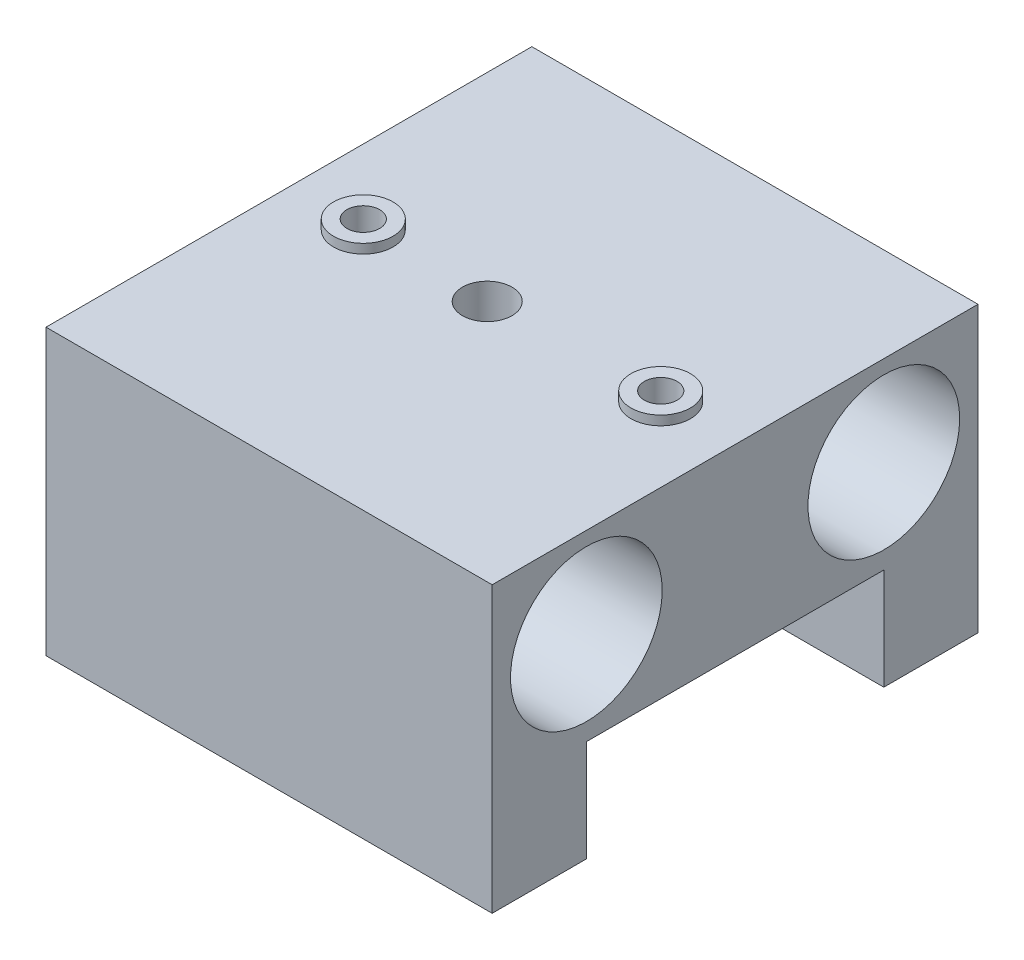
ISO-10303-21;
HEADER;
FILE_DESCRIPTION(('STEP AP214'),'2;1');
FILE_NAME('part.step','',(''),(''),'','','');
FILE_SCHEMA(('AUTOMOTIVE_DESIGN { 1 0 10303 214 1 1 1 1 }'));
ENDSEC;
DATA;
#1=APPLICATION_CONTEXT('core data for automotive mechanical design processes');
#2=APPLICATION_PROTOCOL_DEFINITION('international standard','automotive_design',2000,#1);
#3=PRODUCT_CONTEXT('',#1,'mechanical');
#4=PRODUCT('Part','Part','',(#3));
#5=PRODUCT_RELATED_PRODUCT_CATEGORY('part','',(#4));
#6=PRODUCT_DEFINITION_FORMATION('','',#4);
#7=PRODUCT_DEFINITION_CONTEXT('part definition',#1,'design');
#8=PRODUCT_DEFINITION('design','',#6,#7);
#9=PRODUCT_DEFINITION_SHAPE('','',#8);
#10=(LENGTH_UNIT() NAMED_UNIT(*) SI_UNIT(.MILLI.,.METRE.));
#11=(NAMED_UNIT(*) PLANE_ANGLE_UNIT() SI_UNIT($,.RADIAN.));
#12=(NAMED_UNIT(*) SI_UNIT($,.STERADIAN.) SOLID_ANGLE_UNIT());
#13=UNCERTAINTY_MEASURE_WITH_UNIT(LENGTH_MEASURE(1.E-05),#10,'distance_accuracy_value','');
#14=(GEOMETRIC_REPRESENTATION_CONTEXT(3) GLOBAL_UNCERTAINTY_ASSIGNED_CONTEXT((#13)) GLOBAL_UNIT_ASSIGNED_CONTEXT((#10,
#11,#12)) REPRESENTATION_CONTEXT('',''));
#15=CARTESIAN_POINT('',(0.,0.,0.));
#16=DIRECTION('',(0.,0.,1.));
#17=DIRECTION('',(1.,0.,0.));
#18=AXIS2_PLACEMENT_3D('',#15,#16,#17);
#19=CARTESIAN_POINT('',(25.0137993194186,-3.7,15.));
#20=DIRECTION('',(0.,-1.,0.));
#21=DIRECTION('',(0.,0.,-1.));
#22=AXIS2_PLACEMENT_3D('',#19,#20,#21);
#23=PLANE('',#22);
#24=DIRECTION('',(0.,0.,-1.));
#25=VECTOR('',#24,1.);
#26=CARTESIAN_POINT('',(-20.,-3.70000000000001,24.5));
#27=LINE('',#26,#25);
#28=CARTESIAN_POINT('',(-20.,-3.70000000000001,24.5));
#29=VERTEX_POINT('',#28);
#30=CARTESIAN_POINT('',(-20.,-3.70000000000001,15.));
#31=VERTEX_POINT('',#30);
#32=EDGE_CURVE('E160',#29,#31,#27,.T.);
#33=ORIENTED_EDGE('',*,*,#32,.T.);
#34=DIRECTION('',(-1.,0.,0.));
#35=VECTOR('',#34,1.);
#36=CARTESIAN_POINT('',(25.0137993194186,-3.7,15.));
#37=LINE('',#36,#35);
#38=CARTESIAN_POINT('',(25.,-3.70000000000001,15.));
#39=VERTEX_POINT('',#38);
#40=EDGE_CURVE('E11',#39,#31,#37,.T.);
#41=ORIENTED_EDGE('',*,*,#40,.F.);
#42=DIRECTION('',(0.,0.,-1.));
#43=VECTOR('',#42,1.);
#44=CARTESIAN_POINT('',(25.,-3.70000000000001,24.5));
#45=LINE('',#44,#43);
#46=CARTESIAN_POINT('',(25.,-3.70000000000001,24.5));
#47=VERTEX_POINT('',#46);
#48=EDGE_CURVE('E150',#47,#39,#45,.T.);
#49=ORIENTED_EDGE('',*,*,#48,.F.);
#50=DIRECTION('',(1.,0.,0.));
#51=VECTOR('',#50,1.);
#52=CARTESIAN_POINT('',(-40.1507273121698,-3.70000000000001,24.5));
#53=LINE('',#52,#51);
#54=EDGE_CURVE('E157',#29,#47,#53,.T.);
#55=ORIENTED_EDGE('',*,*,#54,.F.);
#56=EDGE_LOOP('',(#33,#41,#49,#55));
#57=FACE_BOUND('',#56,.T.);
#58=ADVANCED_FACE('F40',(#57),#23,.T.);
#59=CARTESIAN_POINT('',(25.0137993194186,-3.70000000000001,-24.5));
#60=DIRECTION('',(0.,-1.,0.));
#61=DIRECTION('',(0.,0.,-1.));
#62=AXIS2_PLACEMENT_3D('',#59,#60,#61);
#63=PLANE('',#62);
#64=DIRECTION('',(-1.,0.,0.));
#65=VECTOR('',#64,1.);
#66=CARTESIAN_POINT('',(25.0137993194186,-3.7,-15.));
#67=LINE('',#66,#65);
#68=CARTESIAN_POINT('',(25.,-3.7,-15.));
#69=VERTEX_POINT('',#68);
#70=CARTESIAN_POINT('',(-20.,-3.70000000000001,-15.));
#71=VERTEX_POINT('',#70);
#72=EDGE_CURVE('E125',#69,#71,#67,.T.);
#73=ORIENTED_EDGE('',*,*,#72,.T.);
#74=DIRECTION('',(0.,0.,1.));
#75=VECTOR('',#74,1.);
#76=CARTESIAN_POINT('',(-20.,-3.70000000000001,-24.5));
#77=LINE('',#76,#75);
#78=CARTESIAN_POINT('',(-20.,-3.70000000000001,-24.5));
#79=VERTEX_POINT('',#78);
#80=EDGE_CURVE('E137',#79,#71,#77,.T.);
#81=ORIENTED_EDGE('',*,*,#80,.F.);
#82=DIRECTION('',(-1.,0.,0.));
#83=VECTOR('',#82,1.);
#84=CARTESIAN_POINT('',(45.1507273121698,-3.70000000000001,-24.5));
#85=LINE('',#84,#83);
#86=CARTESIAN_POINT('',(25.,-3.70000000000001,-24.5));
#87=VERTEX_POINT('',#86);
#88=EDGE_CURVE('E169',#87,#79,#85,.T.);
#89=ORIENTED_EDGE('',*,*,#88,.F.);
#90=DIRECTION('',(0.,0.,-1.));
#91=VECTOR('',#90,1.);
#92=CARTESIAN_POINT('',(25.,-3.70000000000001,-24.5));
#93=LINE('',#92,#91);
#94=EDGE_CURVE('E156',#69,#87,#93,.T.);
#95=ORIENTED_EDGE('',*,*,#94,.F.);
#96=EDGE_LOOP('',(#73,#81,#89,#95));
#97=FACE_BOUND('',#96,.T.);
#98=ADVANCED_FACE('F261',(#97),#63,.T.);
#99=CARTESIAN_POINT('',(25.0137993194186,6.54,-15.));
#100=DIRECTION('',(0.,-1.,0.));
#101=DIRECTION('',(0.,0.,-1.));
#102=AXIS2_PLACEMENT_3D('',#99,#100,#101);
#103=PLANE('',#102);
#104=DIRECTION('',(0.,0.,1.));
#105=VECTOR('',#104,1.);
#106=CARTESIAN_POINT('',(-20.,6.54,15.));
#107=LINE('',#106,#105);
#108=CARTESIAN_POINT('',(-20.,6.54,-15.));
#109=VERTEX_POINT('',#108);
#110=CARTESIAN_POINT('',(-20.,6.54,15.));
#111=VERTEX_POINT('',#110);
#112=EDGE_CURVE('E128',#109,#111,#107,.T.);
#113=ORIENTED_EDGE('',*,*,#112,.F.);
#114=DIRECTION('',(-1.,0.,0.));
#115=VECTOR('',#114,1.);
#116=CARTESIAN_POINT('',(25.0137993194186,6.54,-15.));
#117=LINE('',#116,#115);
#118=CARTESIAN_POINT('',(25.,6.54,-15.));
#119=VERTEX_POINT('',#118);
#120=EDGE_CURVE('E114',#119,#109,#117,.T.);
#121=ORIENTED_EDGE('',*,*,#120,.F.);
#122=DIRECTION('',(0.,0.,1.));
#123=VECTOR('',#122,1.);
#124=CARTESIAN_POINT('',(25.,6.54,15.));
#125=LINE('',#124,#123);
#126=CARTESIAN_POINT('',(25.,6.54,15.));
#127=VERTEX_POINT('',#126);
#128=EDGE_CURVE('E140',#119,#127,#125,.T.);
#129=ORIENTED_EDGE('',*,*,#128,.T.);
#130=DIRECTION('',(-1.,0.,0.));
#131=VECTOR('',#130,1.);
#132=CARTESIAN_POINT('',(25.0137993194186,6.54,15.));
#133=LINE('',#132,#131);
#134=EDGE_CURVE('E49',#127,#111,#133,.T.);
#135=ORIENTED_EDGE('',*,*,#134,.T.);
#136=EDGE_LOOP('',(#113,#121,#129,#135));
#137=FACE_BOUND('',#136,.T.);
#138=CARTESIAN_POINT('',(0.,6.54,0.));
#139=DIRECTION('',(0.,1.,0.));
#140=DIRECTION('',(0.,0.,1.));
#141=AXIS2_PLACEMENT_3D('',#138,#139,#140);
#142=CIRCLE('',#141,2.5);
#143=CARTESIAN_POINT('',(0.,6.54,2.5));
#144=VERTEX_POINT('',#143);
#145=EDGE_CURVE('E172',#144,#144,#142,.F.);
#146=ORIENTED_EDGE('',*,*,#145,.F.);
#147=EDGE_LOOP('',(#146));
#148=FACE_BOUND('',#147,.T.);
#149=ADVANCED_FACE('F129',(#137,#148),#103,.T.);
#150=CARTESIAN_POINT('',(25.0137993194186,-3.7,-15.));
#151=DIRECTION('',(0.,0.,1.));
#152=DIRECTION('',(1.,0.,0.));
#153=AXIS2_PLACEMENT_3D('',#150,#151,#152);
#154=PLANE('',#153);
#155=DIRECTION('',(0.,1.,0.));
#156=VECTOR('',#155,1.);
#157=CARTESIAN_POINT('',(-20.,15.9418382848813,-15.));
#158=LINE('',#157,#156);
#159=EDGE_CURVE('E119',#71,#109,#158,.T.);
#160=ORIENTED_EDGE('',*,*,#159,.F.);
#161=ORIENTED_EDGE('',*,*,#72,.F.);
#162=DIRECTION('',(0.,1.,0.));
#163=VECTOR('',#162,1.);
#164=CARTESIAN_POINT('',(25.,15.9418382848813,-15.));
#165=LINE('',#164,#163);
#166=EDGE_CURVE('E121',#69,#119,#165,.T.);
#167=ORIENTED_EDGE('',*,*,#166,.T.);
#168=ORIENTED_EDGE('',*,*,#120,.T.);
#169=EDGE_LOOP('',(#160,#161,#167,#168));
#170=FACE_BOUND('',#169,.T.);
#171=ADVANCED_FACE('F116',(#170),#154,.T.);
#172=CARTESIAN_POINT('',(25.0137993194186,6.54,15.));
#173=DIRECTION('',(0.,0.,-1.));
#174=DIRECTION('',(-1.,0.,0.));
#175=AXIS2_PLACEMENT_3D('',#172,#173,#174);
#176=PLANE('',#175);
#177=DIRECTION('',(0.,-1.,0.));
#178=VECTOR('',#177,1.);
#179=CARTESIAN_POINT('',(-20.,15.9418382848813,15.));
#180=LINE('',#179,#178);
#181=EDGE_CURVE('E133',#111,#31,#180,.T.);
#182=ORIENTED_EDGE('',*,*,#181,.F.);
#183=ORIENTED_EDGE('',*,*,#134,.F.);
#184=DIRECTION('',(0.,-1.,0.));
#185=VECTOR('',#184,1.);
#186=CARTESIAN_POINT('',(25.,15.9418382848813,15.));
#187=LINE('',#186,#185);
#188=EDGE_CURVE('E44',#127,#39,#187,.T.);
#189=ORIENTED_EDGE('',*,*,#188,.T.);
#190=ORIENTED_EDGE('',*,*,#40,.T.);
#191=EDGE_LOOP('',(#182,#183,#189,#190));
#192=FACE_BOUND('',#191,.T.);
#193=ADVANCED_FACE('F146',(#192),#176,.T.);
#194=CARTESIAN_POINT('',(17.5,15.,0.));
#195=DIRECTION('',(0.,1.,0.));
#196=DIRECTION('',(0.,0.,1.));
#197=AXIS2_PLACEMENT_3D('',#194,#195,#196);
#198=CONICAL_SURFACE('',#197,1.65,1.02974425867665);
#199=CARTESIAN_POINT('',(17.5,14.0085799786045,0.));
#200=VERTEX_POINT('',#199);
#201=VERTEX_LOOP('',#200);
#202=FACE_BOUND('',#201,.T.);
#203=CARTESIAN_POINT('',(17.5,15.,0.));
#204=DIRECTION('',(0.,1.,0.));
#205=DIRECTION('',(0.,0.,1.));
#206=AXIS2_PLACEMENT_3D('',#203,#204,#205);
#207=CIRCLE('',#206,1.65);
#208=CARTESIAN_POINT('',(17.5,15.,1.65));
#209=VERTEX_POINT('',#208);
#210=EDGE_CURVE('E194',#209,#209,#207,.T.);
#211=ORIENTED_EDGE('',*,*,#210,.T.);
#212=EDGE_LOOP('',(#211));
#213=FACE_BOUND('',#212,.T.);
#214=ADVANCED_FACE('F248',(#202,#213),#198,.F.);
#215=CARTESIAN_POINT('',(-12.5,15.,0.));
#216=DIRECTION('',(0.,1.,0.));
#217=DIRECTION('',(0.,0.,1.));
#218=AXIS2_PLACEMENT_3D('',#215,#216,#217);
#219=CONICAL_SURFACE('',#218,1.65,1.02974425867665);
#220=CARTESIAN_POINT('',(-12.5,14.0085799786045,0.));
#221=VERTEX_POINT('',#220);
#222=VERTEX_LOOP('',#221);
#223=FACE_BOUND('',#222,.T.);
#224=CARTESIAN_POINT('',(-12.5,15.,0.));
#225=DIRECTION('',(0.,1.,0.));
#226=DIRECTION('',(0.,0.,1.));
#227=AXIS2_PLACEMENT_3D('',#224,#225,#226);
#228=CIRCLE('',#227,1.65);
#229=CARTESIAN_POINT('',(-12.5,15.,1.65));
#230=VERTEX_POINT('',#229);
#231=EDGE_CURVE('E191',#230,#230,#228,.T.);
#232=ORIENTED_EDGE('',*,*,#231,.T.);
#233=EDGE_LOOP('',(#232));
#234=FACE_BOUND('',#233,.T.);
#235=ADVANCED_FACE('F250',(#223,#234),#219,.F.);
#236=CARTESIAN_POINT('',(17.5,25.,0.));
#237=DIRECTION('',(0.,1.,0.));
#238=DIRECTION('',(0.,0.,1.));
#239=AXIS2_PLACEMENT_3D('',#236,#237,#238);
#240=CYLINDRICAL_SURFACE('',#239,1.65);
#241=ORIENTED_EDGE('',*,*,#210,.F.);
#242=EDGE_LOOP('',(#241));
#243=FACE_BOUND('',#242,.T.);
#244=CARTESIAN_POINT('',(17.5,25.94183835,0.));
#245=DIRECTION('',(0.,1.,0.));
#246=DIRECTION('',(0.,0.,1.));
#247=AXIS2_PLACEMENT_3D('',#244,#245,#246);
#248=CIRCLE('',#247,1.64999999999999);
#249=CARTESIAN_POINT('',(17.5,25.94183835,1.64999999999999));
#250=VERTEX_POINT('',#249);
#251=EDGE_CURVE('E222',#250,#250,#248,.T.);
#252=ORIENTED_EDGE('',*,*,#251,.T.);
#253=EDGE_LOOP('',(#252));
#254=FACE_BOUND('',#253,.T.);
#255=ADVANCED_FACE('F257',(#243,#254),#240,.F.);
#256=CARTESIAN_POINT('',(-12.5,25.,0.));
#257=DIRECTION('',(0.,1.,0.));
#258=DIRECTION('',(0.,0.,1.));
#259=AXIS2_PLACEMENT_3D('',#256,#257,#258);
#260=CYLINDRICAL_SURFACE('',#259,1.64999999999999);
#261=ORIENTED_EDGE('',*,*,#231,.F.);
#262=EDGE_LOOP('',(#261));
#263=FACE_BOUND('',#262,.T.);
#264=CARTESIAN_POINT('',(-12.5,25.94183835,0.));
#265=DIRECTION('',(0.,1.,0.));
#266=DIRECTION('',(0.,0.,1.));
#267=AXIS2_PLACEMENT_3D('',#264,#265,#266);
#268=CIRCLE('',#267,1.65);
#269=CARTESIAN_POINT('',(-12.5,25.94183835,1.65));
#270=VERTEX_POINT('',#269);
#271=EDGE_CURVE('E213',#270,#270,#268,.T.);
#272=ORIENTED_EDGE('',*,*,#271,.T.);
#273=EDGE_LOOP('',(#272));
#274=FACE_BOUND('',#273,.T.);
#275=ADVANCED_FACE('F265',(#263,#274),#260,.F.);
#276=CARTESIAN_POINT('',(17.5,25.94183835,0.));
#277=DIRECTION('',(0.,1.,0.));
#278=DIRECTION('',(0.,0.,1.));
#279=AXIS2_PLACEMENT_3D('',#276,#277,#278);
#280=PLANE('',#279);
#281=CARTESIAN_POINT('',(17.5,25.94183835,0.));
#282=DIRECTION('',(0.,1.,0.));
#283=DIRECTION('',(0.,0.,1.));
#284=AXIS2_PLACEMENT_3D('',#281,#282,#283);
#285=CIRCLE('',#284,3.);
#286=CARTESIAN_POINT('',(17.5,25.94183835,-3.));
#287=VERTEX_POINT('',#286);
#288=EDGE_CURVE('E218',#287,#287,#285,.T.);
#289=ORIENTED_EDGE('',*,*,#288,.T.);
#290=EDGE_LOOP('',(#289));
#291=FACE_BOUND('',#290,.T.);
#292=ORIENTED_EDGE('',*,*,#251,.F.);
#293=EDGE_LOOP('',(#292));
#294=FACE_BOUND('',#293,.T.);
#295=ADVANCED_FACE('F275',(#291,#294),#280,.T.);
#296=CARTESIAN_POINT('',(-12.5,25.94183835,0.));
#297=DIRECTION('',(0.,1.,0.));
#298=DIRECTION('',(0.,0.,1.));
#299=AXIS2_PLACEMENT_3D('',#296,#297,#298);
#300=PLANE('',#299);
#301=CARTESIAN_POINT('',(-12.5,25.94183835,0.));
#302=DIRECTION('',(0.,1.,0.));
#303=DIRECTION('',(0.,0.,1.));
#304=AXIS2_PLACEMENT_3D('',#301,#302,#303);
#305=CIRCLE('',#304,3.);
#306=CARTESIAN_POINT('',(-12.5,25.94183835,-3.));
#307=VERTEX_POINT('',#306);
#308=EDGE_CURVE('E207',#307,#307,#305,.T.);
#309=ORIENTED_EDGE('',*,*,#308,.T.);
#310=EDGE_LOOP('',(#309));
#311=FACE_BOUND('',#310,.T.);
#312=ORIENTED_EDGE('',*,*,#271,.F.);
#313=EDGE_LOOP('',(#312));
#314=FACE_BOUND('',#313,.T.);
#315=ADVANCED_FACE('F272',(#311,#314),#300,.T.);
#316=CARTESIAN_POINT('',(17.5,25.94183835,0.));
#317=DIRECTION('',(0.,-1.,0.));
#318=DIRECTION('',(0.,0.,-1.));
#319=AXIS2_PLACEMENT_3D('',#316,#317,#318);
#320=CYLINDRICAL_SURFACE('',#319,3.);
#321=CARTESIAN_POINT('',(17.5,25.,0.));
#322=DIRECTION('',(0.,1.,0.));
#323=DIRECTION('',(0.,0.,1.));
#324=AXIS2_PLACEMENT_3D('',#321,#322,#323);
#325=CIRCLE('',#324,3.);
#326=CARTESIAN_POINT('',(17.5,25.,-3.));
#327=VERTEX_POINT('',#326);
#328=EDGE_CURVE('E219',#327,#327,#325,.T.);
#329=CARTESIAN_POINT('',(17.5,25.94183835,-3.));
#330=CARTESIAN_POINT('',(17.5,25.9320275338542,-3.));
#331=CARTESIAN_POINT('',(17.5,25.9222167177083,-3.));
#332=CARTESIAN_POINT('',(17.5,25.9025950854167,-3.));
#333=CARTESIAN_POINT('',(17.5,25.8927842692708,-3.));
#334=CARTESIAN_POINT('',(17.5,25.8731626369792,-3.));
#335=CARTESIAN_POINT('',(17.5,25.8633518208333,-3.));
#336=CARTESIAN_POINT('',(17.5,25.8437301885417,-3.));
#337=CARTESIAN_POINT('',(17.5,25.8339193723958,-3.));
#338=CARTESIAN_POINT('',(17.5,25.8142977401042,-3.));
#339=CARTESIAN_POINT('',(17.5,25.8044869239583,-3.));
#340=CARTESIAN_POINT('',(17.5,25.7848652916667,-3.));
#341=CARTESIAN_POINT('',(17.5,25.7750544755208,-3.));
#342=CARTESIAN_POINT('',(17.5,25.7554328432292,-3.));
#343=CARTESIAN_POINT('',(17.5,25.7456220270833,-3.));
#344=CARTESIAN_POINT('',(17.5,25.7260003947917,-3.));
#345=CARTESIAN_POINT('',(17.5,25.7161895786458,-3.));
#346=CARTESIAN_POINT('',(17.5,25.6965679463542,-3.));
#347=CARTESIAN_POINT('',(17.5,25.6867571302083,-3.));
#348=CARTESIAN_POINT('',(17.5,25.6671354979167,-3.));
#349=CARTESIAN_POINT('',(17.5,25.6573246817708,-3.));
#350=CARTESIAN_POINT('',(17.5,25.6377030494792,-3.));
#351=CARTESIAN_POINT('',(17.5,25.6278922333333,-3.));
#352=CARTESIAN_POINT('',(17.5,25.6082706010417,-3.));
#353=CARTESIAN_POINT('',(17.5,25.5984597848958,-3.));
#354=CARTESIAN_POINT('',(17.5,25.5788381526042,-3.));
#355=CARTESIAN_POINT('',(17.5,25.5690273364583,-3.));
#356=CARTESIAN_POINT('',(17.5,25.5494057041667,-3.));
#357=CARTESIAN_POINT('',(17.5,25.5395948880208,-3.));
#358=CARTESIAN_POINT('',(17.5,25.5199732557292,-3.));
#359=CARTESIAN_POINT('',(17.5,25.5101624395833,-3.));
#360=CARTESIAN_POINT('',(17.5,25.4905408072917,-3.));
#361=CARTESIAN_POINT('',(17.5,25.4807299911458,-3.));
#362=CARTESIAN_POINT('',(17.5,25.4611083588542,-3.));
#363=CARTESIAN_POINT('',(17.5,25.4512975427083,-3.));
#364=CARTESIAN_POINT('',(17.5,25.4316759104167,-3.));
#365=CARTESIAN_POINT('',(17.5,25.4218650942708,-3.));
#366=CARTESIAN_POINT('',(17.5,25.4022434619792,-3.));
#367=CARTESIAN_POINT('',(17.5,25.3924326458333,-3.));
#368=CARTESIAN_POINT('',(17.5,25.3728110135417,-3.));
#369=CARTESIAN_POINT('',(17.5,25.3630001973958,-3.));
#370=CARTESIAN_POINT('',(17.5,25.3433785651042,-3.));
#371=CARTESIAN_POINT('',(17.5,25.3335677489583,-3.));
#372=CARTESIAN_POINT('',(17.5,25.3139461166667,-3.));
#373=CARTESIAN_POINT('',(17.5,25.3041353005208,-3.));
#374=CARTESIAN_POINT('',(17.5,25.2845136682292,-3.));
#375=CARTESIAN_POINT('',(17.5,25.2747028520833,-3.));
#376=CARTESIAN_POINT('',(17.5,25.2550812197917,-3.));
#377=CARTESIAN_POINT('',(17.5,25.2452704036458,-3.));
#378=CARTESIAN_POINT('',(17.5,25.2256487713542,-3.));
#379=CARTESIAN_POINT('',(17.5,25.2158379552083,-3.));
#380=CARTESIAN_POINT('',(17.5,25.1962163229167,-3.));
#381=CARTESIAN_POINT('',(17.5,25.1864055067708,-3.));
#382=CARTESIAN_POINT('',(17.5,25.1667838744792,-3.));
#383=CARTESIAN_POINT('',(17.5,25.1569730583333,-3.));
#384=CARTESIAN_POINT('',(17.5,25.1373514260417,-3.));
#385=CARTESIAN_POINT('',(17.5,25.1275406098958,-3.));
#386=CARTESIAN_POINT('',(17.5,25.1079189776042,-3.));
#387=CARTESIAN_POINT('',(17.5,25.0981081614583,-3.));
#388=CARTESIAN_POINT('',(17.5,25.0784865291667,-3.));
#389=CARTESIAN_POINT('',(17.5,25.0686757130208,-3.));
#390=CARTESIAN_POINT('',(17.5,25.0490540807292,-3.));
#391=CARTESIAN_POINT('',(17.5,25.0392432645833,-3.));
#392=CARTESIAN_POINT('',(17.5,25.0196216322917,-3.));
#393=CARTESIAN_POINT('',(17.5,25.0098108161458,-3.));
#394=CARTESIAN_POINT('',(17.5,25.,-3.));
#395=B_SPLINE_CURVE_WITH_KNOTS('',3,(#329,#330,#331,#332,#333,#334,#335,#336,#337,#338,#339,
#340,#341,#342,#343,#344,#345,#346,#347,#348,#349,#350,#351,#352,#353,#354,#355,#356,#357,#358,
#359,#360,#361,#362,#363,#364,#365,#366,#367,#368,#369,#370,#371,#372,#373,#374,#375,#376,#377,
#378,#379,#380,#381,#382,#383,#384,#385,#386,#387,#388,#389,#390,#391,#392,#393,#394),
.UNSPECIFIED.,.F.,.F.,(4,2,2,2,2,2,2,2,2,2,2,2,2,2,2,2,2,2,2,2,2,2,2,2,2,2,2,2,2,2,2,2,4),(0.,
0.0294324484374983,0.0588648968750001,0.0882973453124984,0.11772979375,0.147162242187499,
0.176594690625,0.206027139062499,0.2354595875,0.264892035937499,0.294324484375,
0.323756932812499,0.353189381250001,0.382621829687499,0.412054278125001,0.441486726562499,
0.470919175000001,0.500351623437499,0.529784071875001,0.559216520312499,0.588648968749998,
0.618081417187499,0.647513865625001,0.676946314062499,0.706378762500001,0.735811210937499,
0.765243659375001,0.7946761078125,0.824108556250001,0.8535410046875,0.882973453125002,
0.9124059015625,0.941838350000002),.UNSPECIFIED.);
#396=EDGE_CURVE('BSEAM243',#287,#327,#395,.T.);
#397=ORIENTED_EDGE('',*,*,#288,.F.);
#398=ORIENTED_EDGE('',*,*,#328,.T.);
#399=ORIENTED_EDGE('',*,*,#396,.T.);
#400=ORIENTED_EDGE('',*,*,#396,.F.);
#401=EDGE_LOOP('',(#397,#399,#398,#400));
#402=FACE_BOUND('',#401,.T.);
#403=ADVANCED_FACE('F243',(#402),#320,.T.);
#404=CARTESIAN_POINT('',(-12.5,25.94183835,0.));
#405=DIRECTION('',(0.,-1.,0.));
#406=DIRECTION('',(0.,0.,-1.));
#407=AXIS2_PLACEMENT_3D('',#404,#405,#406);
#408=CYLINDRICAL_SURFACE('',#407,3.);
#409=CARTESIAN_POINT('',(-12.5,25.,0.));
#410=DIRECTION('',(0.,1.,0.));
#411=DIRECTION('',(0.,0.,1.));
#412=AXIS2_PLACEMENT_3D('',#409,#410,#411);
#413=CIRCLE('',#412,3.);
#414=CARTESIAN_POINT('',(-12.5,25.,-3.));
#415=VERTEX_POINT('',#414);
#416=EDGE_CURVE('E210',#415,#415,#413,.T.);
#417=CARTESIAN_POINT('',(-12.5,25.94183835,-3.));
#418=CARTESIAN_POINT('',(-12.5,25.9320275338542,-3.));
#419=CARTESIAN_POINT('',(-12.5,25.9222167177083,-3.));
#420=CARTESIAN_POINT('',(-12.5,25.9025950854167,-3.));
#421=CARTESIAN_POINT('',(-12.5,25.8927842692708,-3.));
#422=CARTESIAN_POINT('',(-12.5,25.8731626369792,-3.));
#423=CARTESIAN_POINT('',(-12.5,25.8633518208333,-3.));
#424=CARTESIAN_POINT('',(-12.5,25.8437301885417,-3.));
#425=CARTESIAN_POINT('',(-12.5,25.8339193723958,-3.));
#426=CARTESIAN_POINT('',(-12.5,25.8142977401042,-3.));
#427=CARTESIAN_POINT('',(-12.5,25.8044869239583,-3.));
#428=CARTESIAN_POINT('',(-12.5,25.7848652916667,-3.));
#429=CARTESIAN_POINT('',(-12.5,25.7750544755208,-3.));
#430=CARTESIAN_POINT('',(-12.5,25.7554328432292,-3.));
#431=CARTESIAN_POINT('',(-12.5,25.7456220270833,-3.));
#432=CARTESIAN_POINT('',(-12.5,25.7260003947917,-3.));
#433=CARTESIAN_POINT('',(-12.5,25.7161895786458,-3.));
#434=CARTESIAN_POINT('',(-12.5,25.6965679463542,-3.));
#435=CARTESIAN_POINT('',(-12.5,25.6867571302083,-3.));
#436=CARTESIAN_POINT('',(-12.5,25.6671354979167,-3.));
#437=CARTESIAN_POINT('',(-12.5,25.6573246817708,-3.));
#438=CARTESIAN_POINT('',(-12.5,25.6377030494792,-3.));
#439=CARTESIAN_POINT('',(-12.5,25.6278922333333,-3.));
#440=CARTESIAN_POINT('',(-12.5,25.6082706010417,-3.));
#441=CARTESIAN_POINT('',(-12.5,25.5984597848958,-3.));
#442=CARTESIAN_POINT('',(-12.5,25.5788381526042,-3.));
#443=CARTESIAN_POINT('',(-12.5,25.5690273364583,-3.));
#444=CARTESIAN_POINT('',(-12.5,25.5494057041667,-3.));
#445=CARTESIAN_POINT('',(-12.5,25.5395948880208,-3.));
#446=CARTESIAN_POINT('',(-12.5,25.5199732557292,-3.));
#447=CARTESIAN_POINT('',(-12.5,25.5101624395833,-3.));
#448=CARTESIAN_POINT('',(-12.5,25.4905408072917,-3.));
#449=CARTESIAN_POINT('',(-12.5,25.4807299911458,-3.));
#450=CARTESIAN_POINT('',(-12.5,25.4611083588542,-3.));
#451=CARTESIAN_POINT('',(-12.5,25.4512975427083,-3.));
#452=CARTESIAN_POINT('',(-12.5,25.4316759104167,-3.));
#453=CARTESIAN_POINT('',(-12.5,25.4218650942708,-3.));
#454=CARTESIAN_POINT('',(-12.5,25.4022434619792,-3.));
#455=CARTESIAN_POINT('',(-12.5,25.3924326458333,-3.));
#456=CARTESIAN_POINT('',(-12.5,25.3728110135417,-3.));
#457=CARTESIAN_POINT('',(-12.5,25.3630001973958,-3.));
#458=CARTESIAN_POINT('',(-12.5,25.3433785651042,-3.));
#459=CARTESIAN_POINT('',(-12.5,25.3335677489583,-3.));
#460=CARTESIAN_POINT('',(-12.5,25.3139461166667,-3.));
#461=CARTESIAN_POINT('',(-12.5,25.3041353005208,-3.));
#462=CARTESIAN_POINT('',(-12.5,25.2845136682292,-3.));
#463=CARTESIAN_POINT('',(-12.5,25.2747028520833,-3.));
#464=CARTESIAN_POINT('',(-12.5,25.2550812197917,-3.));
#465=CARTESIAN_POINT('',(-12.5,25.2452704036458,-3.));
#466=CARTESIAN_POINT('',(-12.5,25.2256487713542,-3.));
#467=CARTESIAN_POINT('',(-12.5,25.2158379552083,-3.));
#468=CARTESIAN_POINT('',(-12.5,25.1962163229167,-3.));
#469=CARTESIAN_POINT('',(-12.5,25.1864055067708,-3.));
#470=CARTESIAN_POINT('',(-12.5,25.1667838744792,-3.));
#471=CARTESIAN_POINT('',(-12.5,25.1569730583333,-3.));
#472=CARTESIAN_POINT('',(-12.5,25.1373514260417,-3.));
#473=CARTESIAN_POINT('',(-12.5,25.1275406098958,-3.));
#474=CARTESIAN_POINT('',(-12.5,25.1079189776042,-3.));
#475=CARTESIAN_POINT('',(-12.5,25.0981081614583,-3.));
#476=CARTESIAN_POINT('',(-12.5,25.0784865291667,-3.));
#477=CARTESIAN_POINT('',(-12.5,25.0686757130208,-3.));
#478=CARTESIAN_POINT('',(-12.5,25.0490540807292,-3.));
#479=CARTESIAN_POINT('',(-12.5,25.0392432645833,-3.));
#480=CARTESIAN_POINT('',(-12.5,25.0196216322917,-3.));
#481=CARTESIAN_POINT('',(-12.5,25.0098108161458,-3.));
#482=CARTESIAN_POINT('',(-12.5,25.,-3.));
#483=B_SPLINE_CURVE_WITH_KNOTS('',3,(#417,#418,#419,#420,#421,#422,#423,#424,#425,#426,#427,
#428,#429,#430,#431,#432,#433,#434,#435,#436,#437,#438,#439,#440,#441,#442,#443,#444,#445,#446,
#447,#448,#449,#450,#451,#452,#453,#454,#455,#456,#457,#458,#459,#460,#461,#462,#463,#464,#465,
#466,#467,#468,#469,#470,#471,#472,#473,#474,#475,#476,#477,#478,#479,#480,#481,#482),
.UNSPECIFIED.,.F.,.F.,(4,2,2,2,2,2,2,2,2,2,2,2,2,2,2,2,2,2,2,2,2,2,2,2,2,2,2,2,2,2,2,2,4),(0.,
0.0294324484374983,0.0588648968750001,0.0882973453124984,0.11772979375,0.147162242187499,
0.176594690625,0.206027139062499,0.2354595875,0.264892035937499,0.294324484375,
0.323756932812499,0.353189381250001,0.382621829687499,0.412054278125001,0.441486726562499,
0.470919175000001,0.500351623437499,0.529784071875001,0.559216520312499,0.588648968749998,
0.618081417187499,0.647513865625001,0.676946314062499,0.706378762500001,0.735811210937499,
0.765243659375001,0.7946761078125,0.824108556250001,0.8535410046875,0.882973453125002,
0.9124059015625,0.941838350000002),.UNSPECIFIED.);
#484=EDGE_CURVE('BSEAM234',#307,#415,#483,.T.);
#485=ORIENTED_EDGE('',*,*,#308,.F.);
#486=ORIENTED_EDGE('',*,*,#416,.T.);
#487=ORIENTED_EDGE('',*,*,#484,.T.);
#488=ORIENTED_EDGE('',*,*,#484,.F.);
#489=EDGE_LOOP('',(#485,#487,#486,#488));
#490=FACE_BOUND('',#489,.T.);
#491=ADVANCED_FACE('F234',(#490),#408,.T.);
#492=CARTESIAN_POINT('',(-20.,15.9418382848813,24.5));
#493=DIRECTION('',(0.,0.,1.));
#494=DIRECTION('',(1.,0.,0.));
#495=AXIS2_PLACEMENT_3D('',#492,#493,#494);
#496=PLANE('',#495);
#497=DIRECTION('',(1.,0.,0.));
#498=VECTOR('',#497,1.);
#499=CARTESIAN_POINT('',(-24.,25.,24.5));
#500=LINE('',#499,#498);
#501=CARTESIAN_POINT('',(-20.,25.,24.5));
#502=VERTEX_POINT('',#501);
#503=CARTESIAN_POINT('',(25.,25.,24.5));
#504=VERTEX_POINT('',#503);
#505=EDGE_CURVE('E165',#502,#504,#500,.T.);
#506=ORIENTED_EDGE('',*,*,#505,.F.);
#507=DIRECTION('',(0.,-1.,0.));
#508=VECTOR('',#507,1.);
#509=CARTESIAN_POINT('',(-20.,15.9418382848813,24.5));
#510=LINE('',#509,#508);
#511=EDGE_CURVE('E175',#502,#29,#510,.T.);
#512=ORIENTED_EDGE('',*,*,#511,.T.);
#513=ORIENTED_EDGE('',*,*,#54,.T.);
#514=DIRECTION('',(0.,-1.,0.));
#515=VECTOR('',#514,1.);
#516=CARTESIAN_POINT('',(25.,15.9418382848813,24.5));
#517=LINE('',#516,#515);
#518=EDGE_CURVE('E152',#504,#47,#517,.T.);
#519=ORIENTED_EDGE('',*,*,#518,.F.);
#520=EDGE_LOOP('',(#506,#512,#513,#519));
#521=FACE_BOUND('',#520,.T.);
#522=ADVANCED_FACE('F231',(#521),#496,.T.);
#523=CARTESIAN_POINT('',(-25.5,15.9418382848813,-15.));
#524=DIRECTION('',(1.,0.,0.));
#525=DIRECTION('',(0.,0.,-1.));
#526=AXIS2_PLACEMENT_3D('',#523,#524,#525);
#527=CYLINDRICAL_SURFACE('',#526,7.65);
#528=CARTESIAN_POINT('',(-20.,15.9418382848813,-15.));
#529=DIRECTION('',(-1.,0.,0.));
#530=DIRECTION('',(0.,0.,1.));
#531=AXIS2_PLACEMENT_3D('',#528,#529,#530);
#532=CIRCLE('',#531,7.65);
#533=CARTESIAN_POINT('',(-20.,15.9418382848813,-7.35));
#534=VERTEX_POINT('',#533);
#535=EDGE_CURVE('E200',#534,#534,#532,.T.);
#536=ORIENTED_EDGE('',*,*,#535,.T.);
#537=EDGE_LOOP('',(#536));
#538=FACE_BOUND('',#537,.T.);
#539=CARTESIAN_POINT('',(25.,15.9418382848813,-15.));
#540=DIRECTION('',(1.,0.,0.));
#541=DIRECTION('',(0.,0.,-1.));
#542=AXIS2_PLACEMENT_3D('',#539,#540,#541);
#543=CIRCLE('',#542,7.65);
#544=CARTESIAN_POINT('',(25.,15.9418382848813,-22.65));
#545=VERTEX_POINT('',#544);
#546=EDGE_CURVE('E204',#545,#545,#543,.T.);
#547=ORIENTED_EDGE('',*,*,#546,.T.);
#548=EDGE_LOOP('',(#547));
#549=FACE_BOUND('',#548,.T.);
#550=ADVANCED_FACE('F233',(#538,#549),#527,.F.);
#551=CARTESIAN_POINT('',(-25.5,15.9418382848813,15.));
#552=DIRECTION('',(1.,0.,0.));
#553=DIRECTION('',(0.,0.,-1.));
#554=AXIS2_PLACEMENT_3D('',#551,#552,#553);
#555=CYLINDRICAL_SURFACE('',#554,7.65);
#556=CARTESIAN_POINT('',(-20.,15.9418382848813,15.));
#557=DIRECTION('',(-1.,0.,0.));
#558=DIRECTION('',(0.,0.,1.));
#559=AXIS2_PLACEMENT_3D('',#556,#557,#558);
#560=CIRCLE('',#559,7.65);
#561=CARTESIAN_POINT('',(-20.,15.9418382848813,22.65));
#562=VERTEX_POINT('',#561);
#563=EDGE_CURVE('E197',#562,#562,#560,.T.);
#564=ORIENTED_EDGE('',*,*,#563,.T.);
#565=EDGE_LOOP('',(#564));
#566=FACE_BOUND('',#565,.T.);
#567=CARTESIAN_POINT('',(25.,15.9418382848813,15.));
#568=DIRECTION('',(1.,0.,0.));
#569=DIRECTION('',(0.,0.,-1.));
#570=AXIS2_PLACEMENT_3D('',#567,#568,#569);
#571=CIRCLE('',#570,7.65);
#572=CARTESIAN_POINT('',(25.,15.9418382848813,7.35));
#573=VERTEX_POINT('',#572);
#574=EDGE_CURVE('E203',#573,#573,#571,.T.);
#575=ORIENTED_EDGE('',*,*,#574,.T.);
#576=EDGE_LOOP('',(#575));
#577=FACE_BOUND('',#576,.T.);
#578=ADVANCED_FACE('F240',(#566,#577),#555,.F.);
#579=CARTESIAN_POINT('',(-20.,15.9418382848813,15.));
#580=DIRECTION('',(-1.,0.,0.));
#581=DIRECTION('',(0.,0.,1.));
#582=AXIS2_PLACEMENT_3D('',#579,#580,#581);
#583=PLANE('',#582);
#584=ORIENTED_EDGE('',*,*,#563,.F.);
#585=EDGE_LOOP('',(#584));
#586=FACE_BOUND('',#585,.T.);
#587=ORIENTED_EDGE('',*,*,#535,.F.);
#588=EDGE_LOOP('',(#587));
#589=FACE_BOUND('',#588,.T.);
#590=ORIENTED_EDGE('',*,*,#80,.T.);
#591=ORIENTED_EDGE('',*,*,#159,.T.);
#592=ORIENTED_EDGE('',*,*,#112,.T.);
#593=ORIENTED_EDGE('',*,*,#181,.T.);
#594=ORIENTED_EDGE('',*,*,#32,.F.);
#595=ORIENTED_EDGE('',*,*,#511,.F.);
#596=DIRECTION('',(0.,0.,1.));
#597=VECTOR('',#596,1.);
#598=CARTESIAN_POINT('',(-20.,25.,9.));
#599=LINE('',#598,#597);
#600=CARTESIAN_POINT('',(-20.,25.,-24.5));
#601=VERTEX_POINT('',#600);
#602=EDGE_CURVE('E176',#601,#502,#599,.T.);
#603=ORIENTED_EDGE('',*,*,#602,.F.);
#604=DIRECTION('',(0.,1.,0.));
#605=VECTOR('',#604,1.);
#606=CARTESIAN_POINT('',(-20.,15.9418382848813,-24.5));
#607=LINE('',#606,#605);
#608=EDGE_CURVE('E57',#79,#601,#607,.T.);
#609=ORIENTED_EDGE('',*,*,#608,.F.);
#610=EDGE_LOOP('',(#590,#591,#592,#593,#594,#595,#603,#609));
#611=FACE_BOUND('',#610,.T.);
#612=ADVANCED_FACE('F135',(#586,#589,#611),#583,.T.);
#613=CARTESIAN_POINT('',(25.,15.9418382848813,15.));
#614=DIRECTION('',(-1.,0.,0.));
#615=DIRECTION('',(0.,0.,1.));
#616=AXIS2_PLACEMENT_3D('',#613,#614,#615);
#617=PLANE('',#616);
#618=ORIENTED_EDGE('',*,*,#546,.F.);
#619=EDGE_LOOP('',(#618));
#620=FACE_BOUND('',#619,.T.);
#621=ORIENTED_EDGE('',*,*,#574,.F.);
#622=EDGE_LOOP('',(#621));
#623=FACE_BOUND('',#622,.T.);
#624=ORIENTED_EDGE('',*,*,#166,.F.);
#625=ORIENTED_EDGE('',*,*,#94,.T.);
#626=DIRECTION('',(0.,1.,0.));
#627=VECTOR('',#626,1.);
#628=CARTESIAN_POINT('',(25.,15.9418382848813,-24.5));
#629=LINE('',#628,#627);
#630=CARTESIAN_POINT('',(25.,25.,-24.5));
#631=VERTEX_POINT('',#630);
#632=EDGE_CURVE('E64',#87,#631,#629,.T.);
#633=ORIENTED_EDGE('',*,*,#632,.T.);
#634=DIRECTION('',(0.,0.,1.));
#635=VECTOR('',#634,1.);
#636=CARTESIAN_POINT('',(25.,25.,9.));
#637=LINE('',#636,#635);
#638=EDGE_CURVE('E185',#631,#504,#637,.T.);
#639=ORIENTED_EDGE('',*,*,#638,.T.);
#640=ORIENTED_EDGE('',*,*,#518,.T.);
#641=ORIENTED_EDGE('',*,*,#48,.T.);
#642=ORIENTED_EDGE('',*,*,#188,.F.);
#643=ORIENTED_EDGE('',*,*,#128,.F.);
#644=EDGE_LOOP('',(#624,#625,#633,#639,#640,#641,#642,#643));
#645=FACE_BOUND('',#644,.T.);
#646=ADVANCED_FACE('F42',(#620,#623,#645),#617,.F.);
#647=CARTESIAN_POINT('',(-20.,25.,9.));
#648=DIRECTION('',(0.,1.,0.));
#649=DIRECTION('',(0.,0.,1.));
#650=AXIS2_PLACEMENT_3D('',#647,#648,#649);
#651=PLANE('',#650);
#652=ORIENTED_EDGE('',*,*,#416,.F.);
#653=EDGE_LOOP('',(#652));
#654=FACE_BOUND('',#653,.T.);
#655=CARTESIAN_POINT('',(0.,25.,0.));
#656=DIRECTION('',(0.,1.,0.));
#657=DIRECTION('',(0.,0.,1.));
#658=AXIS2_PLACEMENT_3D('',#655,#656,#657);
#659=CIRCLE('',#658,2.5);
#660=CARTESIAN_POINT('',(0.,25.,2.5));
#661=VERTEX_POINT('',#660);
#662=EDGE_CURVE('E188',#661,#661,#659,.T.);
#663=ORIENTED_EDGE('',*,*,#662,.F.);
#664=EDGE_LOOP('',(#663));
#665=FACE_BOUND('',#664,.T.);
#666=ORIENTED_EDGE('',*,*,#602,.T.);
#667=ORIENTED_EDGE('',*,*,#505,.T.);
#668=ORIENTED_EDGE('',*,*,#638,.F.);
#669=DIRECTION('',(1.,0.,0.));
#670=VECTOR('',#669,1.);
#671=CARTESIAN_POINT('',(-24.,25.,-24.5));
#672=LINE('',#671,#670);
#673=EDGE_CURVE('E162',#601,#631,#672,.T.);
#674=ORIENTED_EDGE('',*,*,#673,.F.);
#675=EDGE_LOOP('',(#666,#667,#668,#674));
#676=FACE_BOUND('',#675,.T.);
#677=ORIENTED_EDGE('',*,*,#328,.F.);
#678=EDGE_LOOP('',(#677));
#679=FACE_BOUND('',#678,.T.);
#680=ADVANCED_FACE('F228',(#654,#665,#676,#679),#651,.T.);
#681=CARTESIAN_POINT('',(0.,-42.701,0.));
#682=DIRECTION('',(0.,1.,0.));
#683=DIRECTION('',(0.,0.,1.));
#684=AXIS2_PLACEMENT_3D('',#681,#682,#683);
#685=CYLINDRICAL_SURFACE('',#684,2.5);
#686=ORIENTED_EDGE('',*,*,#145,.T.);
#687=EDGE_LOOP('',(#686));
#688=FACE_BOUND('',#687,.T.);
#689=ORIENTED_EDGE('',*,*,#662,.T.);
#690=EDGE_LOOP('',(#689));
#691=FACE_BOUND('',#690,.T.);
#692=ADVANCED_FACE('F309',(#688,#691),#685,.F.);
#693=CARTESIAN_POINT('',(-20.,15.9418382848813,-24.5));
#694=DIRECTION('',(0.,0.,-1.));
#695=DIRECTION('',(-1.,0.,0.));
#696=AXIS2_PLACEMENT_3D('',#693,#694,#695);
#697=PLANE('',#696);
#698=ORIENTED_EDGE('',*,*,#673,.T.);
#699=ORIENTED_EDGE('',*,*,#632,.F.);
#700=ORIENTED_EDGE('',*,*,#88,.T.);
#701=ORIENTED_EDGE('',*,*,#608,.T.);
#702=EDGE_LOOP('',(#698,#699,#700,#701));
#703=FACE_BOUND('',#702,.T.);
#704=ADVANCED_FACE('F291',(#703),#697,.T.);
#705=CLOSED_SHELL('',(#58,#98,#149,#171,#193,#214,#235,#255,#275,#295,#315,#403,#491,#522,#550,
#578,#612,#646,#680,#692,#704));
#706=MANIFOLD_SOLID_BREP('B2',#705);
#707=ADVANCED_BREP_SHAPE_REPRESENTATION('',(#18,#706),#14);
#708=SHAPE_DEFINITION_REPRESENTATION(#9,#707);
ENDSEC;
END-ISO-10303-21;
